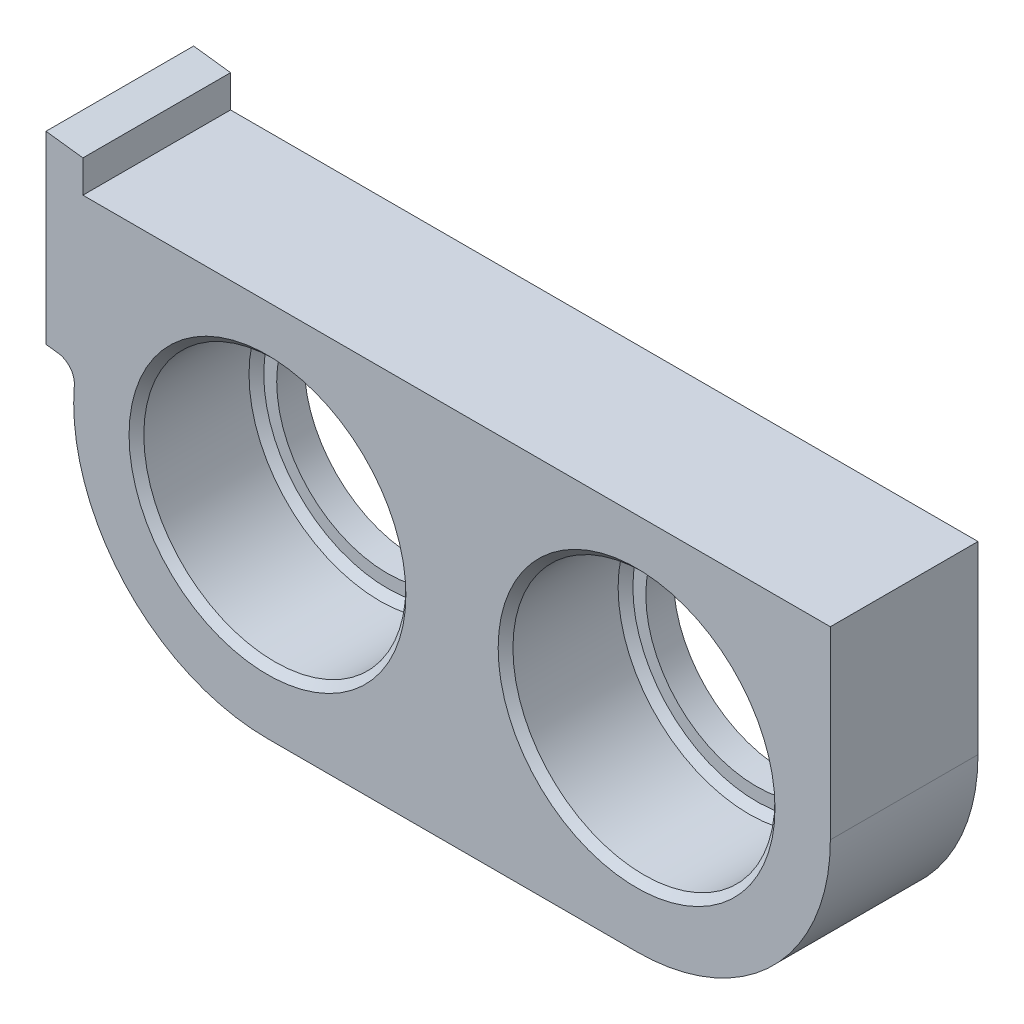
ISO-10303-21;
HEADER;
FILE_DESCRIPTION(('STEP AP214'),'2;1');
FILE_NAME('part.step','',(''),(''),'','','');
FILE_SCHEMA(('AUTOMOTIVE_DESIGN { 1 0 10303 214 1 1 1 1 }'));
ENDSEC;
DATA;
#1=APPLICATION_CONTEXT('core data for automotive mechanical design processes');
#2=APPLICATION_PROTOCOL_DEFINITION('international standard','automotive_design',2000,#1);
#3=PRODUCT_CONTEXT('',#1,'mechanical');
#4=PRODUCT('Part','Part','',(#3));
#5=PRODUCT_RELATED_PRODUCT_CATEGORY('part','',(#4));
#6=PRODUCT_DEFINITION_FORMATION('','',#4);
#7=PRODUCT_DEFINITION_CONTEXT('part definition',#1,'design');
#8=PRODUCT_DEFINITION('design','',#6,#7);
#9=PRODUCT_DEFINITION_SHAPE('','',#8);
#10=(LENGTH_UNIT() NAMED_UNIT(*) SI_UNIT(.MILLI.,.METRE.));
#11=(NAMED_UNIT(*) PLANE_ANGLE_UNIT() SI_UNIT($,.RADIAN.));
#12=(NAMED_UNIT(*) SI_UNIT($,.STERADIAN.) SOLID_ANGLE_UNIT());
#13=UNCERTAINTY_MEASURE_WITH_UNIT(LENGTH_MEASURE(1.E-05),#10,'distance_accuracy_value','');
#14=(GEOMETRIC_REPRESENTATION_CONTEXT(3) GLOBAL_UNCERTAINTY_ASSIGNED_CONTEXT((#13)) GLOBAL_UNIT_ASSIGNED_CONTEXT((#10,
#11,#12)) REPRESENTATION_CONTEXT('',''));
#15=CARTESIAN_POINT('',(0.,0.,0.));
#16=DIRECTION('',(0.,0.,1.));
#17=DIRECTION('',(1.,0.,0.));
#18=AXIS2_PLACEMENT_3D('',#15,#16,#17);
#19=CARTESIAN_POINT('',(0.,0.,8.));
#20=DIRECTION('',(0.,0.,-1.));
#21=DIRECTION('',(-1.,0.,0.));
#22=AXIS2_PLACEMENT_3D('',#19,#20,#21);
#23=CYLINDRICAL_SURFACE('',#22,7.1);
#24=CARTESIAN_POINT('',(0.,0.,1.9));
#25=DIRECTION('',(0.,0.,-1.));
#26=DIRECTION('',(-1.,0.,0.));
#27=AXIS2_PLACEMENT_3D('',#24,#25,#26);
#28=CIRCLE('',#27,7.1);
#29=CARTESIAN_POINT('',(-7.1,0.,1.9));
#30=VERTEX_POINT('',#29);
#31=EDGE_CURVE('E50',#30,#30,#28,.T.);
#32=ORIENTED_EDGE('',*,*,#31,.T.);
#33=EDGE_LOOP('',(#32));
#34=FACE_BOUND('',#33,.T.);
#35=CARTESIAN_POINT('',(0.,0.,7.6));
#36=DIRECTION('',(0.,0.,1.));
#37=DIRECTION('',(1.,0.,0.));
#38=AXIS2_PLACEMENT_3D('',#35,#36,#37);
#39=CIRCLE('',#38,7.1);
#40=CARTESIAN_POINT('',(7.1,0.,7.6));
#41=VERTEX_POINT('',#40);
#42=EDGE_CURVE('E213',#41,#41,#39,.T.);
#43=ORIENTED_EDGE('',*,*,#42,.T.);
#44=EDGE_LOOP('',(#43));
#45=FACE_BOUND('',#44,.T.);
#46=ADVANCED_FACE('F41',(#34,#45),#23,.F.);
#47=CARTESIAN_POINT('',(20.,0.,8.));
#48=DIRECTION('',(0.,0.,-1.));
#49=DIRECTION('',(-1.,0.,0.));
#50=AXIS2_PLACEMENT_3D('',#47,#48,#49);
#51=CYLINDRICAL_SURFACE('',#50,7.1);
#52=CARTESIAN_POINT('',(20.,0.,1.9));
#53=DIRECTION('',(0.,0.,-1.));
#54=DIRECTION('',(-1.,0.,0.));
#55=AXIS2_PLACEMENT_3D('',#52,#53,#54);
#56=CIRCLE('',#55,7.1);
#57=CARTESIAN_POINT('',(12.9,0.,1.9));
#58=VERTEX_POINT('',#57);
#59=EDGE_CURVE('E201',#58,#58,#56,.T.);
#60=ORIENTED_EDGE('',*,*,#59,.T.);
#61=EDGE_LOOP('',(#60));
#62=FACE_BOUND('',#61,.T.);
#63=CARTESIAN_POINT('',(20.,0.,7.6));
#64=DIRECTION('',(0.,0.,1.));
#65=DIRECTION('',(1.,0.,0.));
#66=AXIS2_PLACEMENT_3D('',#63,#64,#65);
#67=CIRCLE('',#66,7.1);
#68=CARTESIAN_POINT('',(27.1,0.,7.6));
#69=VERTEX_POINT('',#68);
#70=EDGE_CURVE('E198',#69,#69,#67,.T.);
#71=ORIENTED_EDGE('',*,*,#70,.T.);
#72=EDGE_LOOP('',(#71));
#73=FACE_BOUND('',#72,.T.);
#74=ADVANCED_FACE('F235',(#62,#73),#51,.F.);
#75=CARTESIAN_POINT('',(0.0615384615384616,0.492307692307694,8.));
#76=DIRECTION('',(0.124034734589208,0.992277876713668,0.));
#77=DIRECTION('',(-0.992277876713668,0.124034734589208,0.));
#78=AXIS2_PLACEMENT_3D('',#75,#76,#77);
#79=PLANE('',#78);
#80=DIRECTION('',(0.992277876713668,-0.124034734589208,0.));
#81=VECTOR('',#80,1.);
#82=CARTESIAN_POINT('',(0.0615384615384616,0.492307692307694,0.));
#83=LINE('',#82,#81);
#84=CARTESIAN_POINT('',(-12.,2.,0.));
#85=VERTEX_POINT('',#84);
#86=CARTESIAN_POINT('',(-11.3386990109921,1.91733737637401,0.));
#87=VERTEX_POINT('',#86);
#88=EDGE_CURVE('E157',#85,#87,#83,.T.);
#89=ORIENTED_EDGE('',*,*,#88,.T.);
#90=DIRECTION('',(0.,0.,1.));
#91=VECTOR('',#90,1.);
#92=CARTESIAN_POINT('',(-11.3386990109921,1.91733737637401,8.));
#93=LINE('',#92,#91);
#94=CARTESIAN_POINT('',(-11.3386990109921,1.91733737637401,8.));
#95=VERTEX_POINT('',#94);
#96=EDGE_CURVE('E57',#87,#95,#93,.T.);
#97=ORIENTED_EDGE('',*,*,#96,.T.);
#98=DIRECTION('',(0.992277876713668,-0.124034734589208,0.));
#99=VECTOR('',#98,1.);
#100=CARTESIAN_POINT('',(0.0615384615384616,0.492307692307694,8.));
#101=LINE('',#100,#99);
#102=CARTESIAN_POINT('',(-12.,2.,8.));
#103=VERTEX_POINT('',#102);
#104=EDGE_CURVE('E173',#103,#95,#101,.T.);
#105=ORIENTED_EDGE('',*,*,#104,.F.);
#106=DIRECTION('',(0.,0.,-1.));
#107=VECTOR('',#106,1.);
#108=CARTESIAN_POINT('',(-12.,2.,8.));
#109=LINE('',#108,#107);
#110=EDGE_CURVE('E156',#103,#85,#109,.T.);
#111=ORIENTED_EDGE('',*,*,#110,.T.);
#112=EDGE_LOOP('',(#89,#97,#105,#111));
#113=FACE_BOUND('',#112,.T.);
#114=ADVANCED_FACE('F240',(#113),#79,.F.);
#115=CARTESIAN_POINT('',(0.,0.,8.));
#116=DIRECTION('',(0.,0.,-1.));
#117=DIRECTION('',(-1.,0.,0.));
#118=AXIS2_PLACEMENT_3D('',#115,#116,#117);
#119=CYLINDRICAL_SURFACE('',#118,10.5);
#120=CARTESIAN_POINT('',(0.,0.,8.));
#121=DIRECTION('',(0.,0.,1.));
#122=DIRECTION('',(1.,0.,0.));
#123=AXIS2_PLACEMENT_3D('',#120,#121,#122);
#124=CIRCLE('',#123,10.5);
#125=CARTESIAN_POINT('',(-10.4659742894438,0.844619543168139,8.));
#126=VERTEX_POINT('',#125);
#127=CARTESIAN_POINT('',(0.,-10.5,8.));
#128=VERTEX_POINT('',#127);
#129=EDGE_CURVE('E314',#126,#128,#124,.T.);
#130=ORIENTED_EDGE('',*,*,#129,.F.);
#131=DIRECTION('',(0.,0.,-1.));
#132=VECTOR('',#131,1.);
#133=CARTESIAN_POINT('',(-10.4659742894438,0.844619543168139,8.));
#134=LINE('',#133,#132);
#135=CARTESIAN_POINT('',(-10.4659742894438,0.844619543168139,0.));
#136=VERTEX_POINT('',#135);
#137=EDGE_CURVE('E191',#126,#136,#134,.T.);
#138=ORIENTED_EDGE('',*,*,#137,.T.);
#139=CARTESIAN_POINT('',(0.,0.,0.));
#140=DIRECTION('',(0.,0.,1.));
#141=DIRECTION('',(1.,0.,0.));
#142=AXIS2_PLACEMENT_3D('',#139,#140,#141);
#143=CIRCLE('',#142,10.5);
#144=CARTESIAN_POINT('',(0.,-10.5,0.));
#145=VERTEX_POINT('',#144);
#146=EDGE_CURVE('E159',#136,#145,#143,.T.);
#147=ORIENTED_EDGE('',*,*,#146,.T.);
#148=DIRECTION('',(0.,0.,-1.));
#149=VECTOR('',#148,1.);
#150=CARTESIAN_POINT('',(0.,-10.5,8.));
#151=LINE('',#150,#149);
#152=EDGE_CURVE('E183',#128,#145,#151,.T.);
#153=ORIENTED_EDGE('',*,*,#152,.F.);
#154=EDGE_LOOP('',(#130,#138,#147,#153));
#155=FACE_BOUND('',#154,.T.);
#156=ADVANCED_FACE('F264',(#155),#119,.T.);
#157=CARTESIAN_POINT('',(0.,-10.5,8.));
#158=DIRECTION('',(0.,1.,0.));
#159=DIRECTION('',(0.,0.,1.));
#160=AXIS2_PLACEMENT_3D('',#157,#158,#159);
#161=PLANE('',#160);
#162=DIRECTION('',(1.,0.,0.));
#163=VECTOR('',#162,1.);
#164=CARTESIAN_POINT('',(0.,-10.5,0.));
#165=LINE('',#164,#163);
#166=CARTESIAN_POINT('',(20.,-10.5,0.));
#167=VERTEX_POINT('',#166);
#168=EDGE_CURVE('E162',#145,#167,#165,.T.);
#169=ORIENTED_EDGE('',*,*,#168,.T.);
#170=DIRECTION('',(0.,0.,-1.));
#171=VECTOR('',#170,1.);
#172=CARTESIAN_POINT('',(20.,-10.5,8.));
#173=LINE('',#172,#171);
#174=CARTESIAN_POINT('',(20.,-10.5,8.));
#175=VERTEX_POINT('',#174);
#176=EDGE_CURVE('E180',#175,#167,#173,.T.);
#177=ORIENTED_EDGE('',*,*,#176,.F.);
#178=DIRECTION('',(1.,0.,0.));
#179=VECTOR('',#178,1.);
#180=CARTESIAN_POINT('',(0.,-10.5,8.));
#181=LINE('',#180,#179);
#182=EDGE_CURVE('E151',#128,#175,#181,.T.);
#183=ORIENTED_EDGE('',*,*,#182,.F.);
#184=ORIENTED_EDGE('',*,*,#152,.T.);
#185=EDGE_LOOP('',(#169,#177,#183,#184));
#186=FACE_BOUND('',#185,.T.);
#187=ADVANCED_FACE('F260',(#186),#161,.F.);
#188=CARTESIAN_POINT('',(20.,0.,8.));
#189=DIRECTION('',(0.,0.,-1.));
#190=DIRECTION('',(-1.,0.,0.));
#191=AXIS2_PLACEMENT_3D('',#188,#189,#190);
#192=CYLINDRICAL_SURFACE('',#191,10.5);
#193=CARTESIAN_POINT('',(20.,0.,0.));
#194=DIRECTION('',(0.,0.,1.));
#195=DIRECTION('',(1.,0.,0.));
#196=AXIS2_PLACEMENT_3D('',#193,#194,#195);
#197=CIRCLE('',#196,10.5);
#198=CARTESIAN_POINT('',(30.5,0.,0.));
#199=VERTEX_POINT('',#198);
#200=EDGE_CURVE('E164',#167,#199,#197,.T.);
#201=ORIENTED_EDGE('',*,*,#200,.T.);
#202=DIRECTION('',(0.,0.,-1.));
#203=VECTOR('',#202,1.);
#204=CARTESIAN_POINT('',(30.5,0.,8.));
#205=LINE('',#204,#203);
#206=CARTESIAN_POINT('',(30.5,0.,8.));
#207=VERTEX_POINT('',#206);
#208=EDGE_CURVE('E178',#207,#199,#205,.T.);
#209=ORIENTED_EDGE('',*,*,#208,.F.);
#210=CARTESIAN_POINT('',(20.,0.,8.));
#211=DIRECTION('',(0.,0.,1.));
#212=DIRECTION('',(1.,0.,0.));
#213=AXIS2_PLACEMENT_3D('',#210,#211,#212);
#214=CIRCLE('',#213,10.5);
#215=EDGE_CURVE('E144',#175,#207,#214,.T.);
#216=ORIENTED_EDGE('',*,*,#215,.F.);
#217=ORIENTED_EDGE('',*,*,#176,.T.);
#218=EDGE_LOOP('',(#201,#209,#216,#217));
#219=FACE_BOUND('',#218,.T.);
#220=ADVANCED_FACE('F257',(#219),#192,.T.);
#221=CARTESIAN_POINT('',(30.5,0.,8.));
#222=DIRECTION('',(1.,0.,0.));
#223=DIRECTION('',(0.,0.,-1.));
#224=AXIS2_PLACEMENT_3D('',#221,#222,#223);
#225=PLANE('',#224);
#226=DIRECTION('',(0.,0.,-1.));
#227=VECTOR('',#226,1.);
#228=CARTESIAN_POINT('',(30.5,10.,9.));
#229=LINE('',#228,#227);
#230=CARTESIAN_POINT('',(30.5,10.,8.));
#231=VERTEX_POINT('',#230);
#232=CARTESIAN_POINT('',(30.5,10.,0.));
#233=VERTEX_POINT('',#232);
#234=EDGE_CURVE('E125',#231,#233,#229,.T.);
#235=ORIENTED_EDGE('',*,*,#234,.F.);
#236=DIRECTION('',(0.,-1.,0.));
#237=VECTOR('',#236,1.);
#238=CARTESIAN_POINT('',(30.5,0.,8.));
#239=LINE('',#238,#237);
#240=EDGE_CURVE('E138',#231,#207,#239,.T.);
#241=ORIENTED_EDGE('',*,*,#240,.T.);
#242=ORIENTED_EDGE('',*,*,#208,.T.);
#243=DIRECTION('',(0.,-1.,0.));
#244=VECTOR('',#243,1.);
#245=CARTESIAN_POINT('',(30.5,0.,0.));
#246=LINE('',#245,#244);
#247=EDGE_CURVE('E140',#233,#199,#246,.T.);
#248=ORIENTED_EDGE('',*,*,#247,.F.);
#249=EDGE_LOOP('',(#235,#241,#242,#248));
#250=FACE_BOUND('',#249,.T.);
#251=ADVANCED_FACE('F136',(#250),#225,.T.);
#252=CARTESIAN_POINT('',(1.29230769230769,10.3384615384615,8.));
#253=DIRECTION('',(0.124034734589208,0.992277876713668,0.));
#254=DIRECTION('',(-0.992277876713668,0.124034734589208,0.));
#255=AXIS2_PLACEMENT_3D('',#252,#253,#254);
#256=PLANE('',#255);
#257=DIRECTION('',(0.,0.,1.));
#258=VECTOR('',#257,1.);
#259=CARTESIAN_POINT('',(-10.,11.75,8.));
#260=LINE('',#259,#258);
#261=CARTESIAN_POINT('',(-10.,11.75,0.));
#262=VERTEX_POINT('',#261);
#263=CARTESIAN_POINT('',(-10.,11.75,8.));
#264=VERTEX_POINT('',#263);
#265=EDGE_CURVE('E326',#262,#264,#260,.T.);
#266=ORIENTED_EDGE('',*,*,#265,.F.);
#267=DIRECTION('',(0.992277876713668,-0.124034734589208,0.));
#268=VECTOR('',#267,1.);
#269=CARTESIAN_POINT('',(1.29230769230769,10.3384615384615,0.));
#270=LINE('',#269,#268);
#271=CARTESIAN_POINT('',(-12.,12.,0.));
#272=VERTEX_POINT('',#271);
#273=EDGE_CURVE('E168',#272,#262,#270,.T.);
#274=ORIENTED_EDGE('',*,*,#273,.F.);
#275=DIRECTION('',(0.,0.,-1.));
#276=VECTOR('',#275,1.);
#277=CARTESIAN_POINT('',(-12.,12.,8.));
#278=LINE('',#277,#276);
#279=CARTESIAN_POINT('',(-12.,12.,8.));
#280=VERTEX_POINT('',#279);
#281=EDGE_CURVE('E176',#280,#272,#278,.T.);
#282=ORIENTED_EDGE('',*,*,#281,.F.);
#283=DIRECTION('',(0.992277876713668,-0.124034734589208,0.));
#284=VECTOR('',#283,1.);
#285=CARTESIAN_POINT('',(1.29230769230769,10.3384615384615,8.));
#286=LINE('',#285,#284);
#287=EDGE_CURVE('E146',#280,#264,#286,.T.);
#288=ORIENTED_EDGE('',*,*,#287,.T.);
#289=EDGE_LOOP('',(#266,#274,#282,#288));
#290=FACE_BOUND('',#289,.T.);
#291=ADVANCED_FACE('F250',(#290),#256,.T.);
#292=CARTESIAN_POINT('',(-12.,0.,8.));
#293=DIRECTION('',(1.,0.,0.));
#294=DIRECTION('',(0.,0.,-1.));
#295=AXIS2_PLACEMENT_3D('',#292,#293,#294);
#296=PLANE('',#295);
#297=DIRECTION('',(0.,-1.,0.));
#298=VECTOR('',#297,1.);
#299=CARTESIAN_POINT('',(-12.,0.,0.));
#300=LINE('',#299,#298);
#301=EDGE_CURVE('E171',#272,#85,#300,.T.);
#302=ORIENTED_EDGE('',*,*,#301,.T.);
#303=ORIENTED_EDGE('',*,*,#110,.F.);
#304=DIRECTION('',(0.,-1.,0.));
#305=VECTOR('',#304,1.);
#306=CARTESIAN_POINT('',(-12.,0.,8.));
#307=LINE('',#306,#305);
#308=EDGE_CURVE('E149',#280,#103,#307,.T.);
#309=ORIENTED_EDGE('',*,*,#308,.F.);
#310=ORIENTED_EDGE('',*,*,#281,.T.);
#311=EDGE_LOOP('',(#302,#303,#309,#310));
#312=FACE_BOUND('',#311,.T.);
#313=ADVANCED_FACE('F247',(#312),#296,.F.);
#314=CARTESIAN_POINT('',(0.,0.,8.));
#315=DIRECTION('',(0.,0.,1.));
#316=DIRECTION('',(1.,0.,0.));
#317=AXIS2_PLACEMENT_3D('',#314,#315,#316);
#318=PLANE('',#317);
#319=CARTESIAN_POINT('',(20.,0.,8.));
#320=DIRECTION('',(0.,0.,1.));
#321=DIRECTION('',(1.,0.,0.));
#322=AXIS2_PLACEMENT_3D('',#319,#320,#321);
#323=CIRCLE('',#322,7.5);
#324=CARTESIAN_POINT('',(27.5,0.,8.));
#325=VERTEX_POINT('',#324);
#326=EDGE_CURVE('E210',#325,#325,#323,.F.);
#327=ORIENTED_EDGE('',*,*,#326,.T.);
#328=EDGE_LOOP('',(#327));
#329=FACE_BOUND('',#328,.T.);
#330=CARTESIAN_POINT('',(0.,0.,8.));
#331=DIRECTION('',(0.,0.,1.));
#332=DIRECTION('',(1.,0.,0.));
#333=AXIS2_PLACEMENT_3D('',#330,#331,#332);
#334=CIRCLE('',#333,7.5);
#335=CARTESIAN_POINT('',(7.5,0.,8.));
#336=VERTEX_POINT('',#335);
#337=EDGE_CURVE('E207',#336,#336,#334,.F.);
#338=ORIENTED_EDGE('',*,*,#337,.T.);
#339=EDGE_LOOP('',(#338));
#340=FACE_BOUND('',#339,.T.);
#341=DIRECTION('',(1.,0.,0.));
#342=VECTOR('',#341,1.);
#343=CARTESIAN_POINT('',(0.,10.,8.));
#344=LINE('',#343,#342);
#345=CARTESIAN_POINT('',(-10.,10.,8.));
#346=VERTEX_POINT('',#345);
#347=EDGE_CURVE('E121',#346,#231,#344,.T.);
#348=ORIENTED_EDGE('',*,*,#347,.F.);
#349=DIRECTION('',(0.,-1.,0.));
#350=VECTOR('',#349,1.);
#351=CARTESIAN_POINT('',(-10.,0.,8.));
#352=LINE('',#351,#350);
#353=EDGE_CURVE('E132',#264,#346,#352,.T.);
#354=ORIENTED_EDGE('',*,*,#353,.F.);
#355=ORIENTED_EDGE('',*,*,#287,.F.);
#356=ORIENTED_EDGE('',*,*,#308,.T.);
#357=ORIENTED_EDGE('',*,*,#104,.T.);
#358=CARTESIAN_POINT('',(-11.4627337455813,0.925059499660343,8.));
#359=DIRECTION('',(0.,0.,1.));
#360=DIRECTION('',(1.,0.,0.));
#361=AXIS2_PLACEMENT_3D('',#358,#359,#360);
#362=CIRCLE('',#361,1.);
#363=EDGE_CURVE('E196',#95,#126,#362,.F.);
#364=ORIENTED_EDGE('',*,*,#363,.T.);
#365=ORIENTED_EDGE('',*,*,#129,.T.);
#366=ORIENTED_EDGE('',*,*,#182,.T.);
#367=ORIENTED_EDGE('',*,*,#215,.T.);
#368=ORIENTED_EDGE('',*,*,#240,.F.);
#369=EDGE_LOOP('',(#348,#354,#355,#356,#357,#364,#365,#366,#367,#368));
#370=FACE_BOUND('',#369,.T.);
#371=ADVANCED_FACE('F142',(#329,#340,#370),#318,.T.);
#372=CARTESIAN_POINT('',(0.,0.,0.));
#373=DIRECTION('',(0.,0.,1.));
#374=DIRECTION('',(1.,0.,0.));
#375=AXIS2_PLACEMENT_3D('',#372,#373,#374);
#376=PLANE('',#375);
#377=DIRECTION('',(0.,-1.,0.));
#378=VECTOR('',#377,1.);
#379=CARTESIAN_POINT('',(-10.,0.,0.));
#380=LINE('',#379,#378);
#381=CARTESIAN_POINT('',(-10.,10.,0.));
#382=VERTEX_POINT('',#381);
#383=EDGE_CURVE('E186',#262,#382,#380,.T.);
#384=ORIENTED_EDGE('',*,*,#383,.T.);
#385=DIRECTION('',(1.,0.,0.));
#386=VECTOR('',#385,1.);
#387=CARTESIAN_POINT('',(0.,10.,0.));
#388=LINE('',#387,#386);
#389=EDGE_CURVE('E189',#382,#233,#388,.T.);
#390=ORIENTED_EDGE('',*,*,#389,.T.);
#391=ORIENTED_EDGE('',*,*,#247,.T.);
#392=ORIENTED_EDGE('',*,*,#200,.F.);
#393=ORIENTED_EDGE('',*,*,#168,.F.);
#394=ORIENTED_EDGE('',*,*,#146,.F.);
#395=CARTESIAN_POINT('',(-11.4627337455813,0.925059499660343,0.));
#396=DIRECTION('',(0.,0.,1.));
#397=DIRECTION('',(1.,0.,0.));
#398=AXIS2_PLACEMENT_3D('',#395,#396,#397);
#399=CIRCLE('',#398,1.);
#400=EDGE_CURVE('E65',#136,#87,#399,.T.);
#401=ORIENTED_EDGE('',*,*,#400,.T.);
#402=ORIENTED_EDGE('',*,*,#88,.F.);
#403=ORIENTED_EDGE('',*,*,#301,.F.);
#404=ORIENTED_EDGE('',*,*,#273,.T.);
#405=EDGE_LOOP('',(#384,#390,#391,#392,#393,#394,#401,#402,#403,#404));
#406=FACE_BOUND('',#405,.T.);
#407=CARTESIAN_POINT('',(20.,0.,0.));
#408=DIRECTION('',(0.,0.,-1.));
#409=DIRECTION('',(-1.,0.,0.));
#410=AXIS2_PLACEMENT_3D('',#407,#408,#409);
#411=CIRCLE('',#410,6.);
#412=CARTESIAN_POINT('',(14.,0.,0.));
#413=VERTEX_POINT('',#412);
#414=EDGE_CURVE('E305',#413,#413,#411,.T.);
#415=ORIENTED_EDGE('',*,*,#414,.F.);
#416=EDGE_LOOP('',(#415));
#417=FACE_BOUND('',#416,.T.);
#418=CARTESIAN_POINT('',(0.,0.,0.));
#419=DIRECTION('',(0.,0.,-1.));
#420=DIRECTION('',(-1.,0.,0.));
#421=AXIS2_PLACEMENT_3D('',#418,#419,#420);
#422=CIRCLE('',#421,6.);
#423=CARTESIAN_POINT('',(-6.,0.,0.));
#424=VERTEX_POINT('',#423);
#425=EDGE_CURVE('E131',#424,#424,#422,.T.);
#426=ORIENTED_EDGE('',*,*,#425,.F.);
#427=EDGE_LOOP('',(#426));
#428=FACE_BOUND('',#427,.T.);
#429=ADVANCED_FACE('F244',(#406,#417,#428),#376,.F.);
#430=CARTESIAN_POINT('',(20.,0.,1.5));
#431=DIRECTION('',(0.,0.,-1.));
#432=DIRECTION('',(-1.,0.,0.));
#433=AXIS2_PLACEMENT_3D('',#430,#431,#432);
#434=PLANE('',#433);
#435=CARTESIAN_POINT('',(20.,0.,1.5));
#436=DIRECTION('',(0.,0.,-1.));
#437=DIRECTION('',(-1.,0.,0.));
#438=AXIS2_PLACEMENT_3D('',#435,#436,#437);
#439=CIRCLE('',#438,6.7);
#440=CARTESIAN_POINT('',(13.3,0.,1.5));
#441=VERTEX_POINT('',#440);
#442=EDGE_CURVE('E204',#441,#441,#439,.F.);
#443=ORIENTED_EDGE('',*,*,#442,.T.);
#444=EDGE_LOOP('',(#443));
#445=FACE_BOUND('',#444,.T.);
#446=CARTESIAN_POINT('',(20.,0.,1.5));
#447=DIRECTION('',(0.,0.,-1.));
#448=DIRECTION('',(-1.,0.,0.));
#449=AXIS2_PLACEMENT_3D('',#446,#447,#448);
#450=CIRCLE('',#449,6.);
#451=CARTESIAN_POINT('',(14.,0.,1.5));
#452=VERTEX_POINT('',#451);
#453=EDGE_CURVE('E160',#452,#452,#450,.T.);
#454=ORIENTED_EDGE('',*,*,#453,.T.);
#455=EDGE_LOOP('',(#454));
#456=FACE_BOUND('',#455,.T.);
#457=ADVANCED_FACE('F297',(#445,#456),#434,.F.);
#458=CARTESIAN_POINT('',(20.,0.,1.5));
#459=DIRECTION('',(0.,0.,-1.));
#460=DIRECTION('',(-1.,0.,0.));
#461=AXIS2_PLACEMENT_3D('',#458,#459,#460);
#462=CYLINDRICAL_SURFACE('',#461,6.);
#463=ORIENTED_EDGE('',*,*,#453,.F.);
#464=EDGE_LOOP('',(#463));
#465=FACE_BOUND('',#464,.T.);
#466=ORIENTED_EDGE('',*,*,#414,.T.);
#467=EDGE_LOOP('',(#466));
#468=FACE_BOUND('',#467,.T.);
#469=ADVANCED_FACE('F300',(#465,#468),#462,.F.);
#470=CARTESIAN_POINT('',(0.,0.,1.5));
#471=DIRECTION('',(0.,0.,-1.));
#472=DIRECTION('',(-1.,0.,0.));
#473=AXIS2_PLACEMENT_3D('',#470,#471,#472);
#474=PLANE('',#473);
#475=CARTESIAN_POINT('',(0.,0.,1.5));
#476=DIRECTION('',(0.,0.,-1.));
#477=DIRECTION('',(-1.,0.,0.));
#478=AXIS2_PLACEMENT_3D('',#475,#476,#477);
#479=CIRCLE('',#478,6.7);
#480=CARTESIAN_POINT('',(-6.7,0.,1.5));
#481=VERTEX_POINT('',#480);
#482=EDGE_CURVE('E11',#481,#481,#479,.F.);
#483=ORIENTED_EDGE('',*,*,#482,.T.);
#484=EDGE_LOOP('',(#483));
#485=FACE_BOUND('',#484,.T.);
#486=CARTESIAN_POINT('',(0.,0.,1.5));
#487=DIRECTION('',(0.,0.,-1.));
#488=DIRECTION('',(-1.,0.,0.));
#489=AXIS2_PLACEMENT_3D('',#486,#487,#488);
#490=CIRCLE('',#489,6.);
#491=CARTESIAN_POINT('',(-6.,0.,1.5));
#492=VERTEX_POINT('',#491);
#493=EDGE_CURVE('E308',#492,#492,#490,.T.);
#494=ORIENTED_EDGE('',*,*,#493,.T.);
#495=EDGE_LOOP('',(#494));
#496=FACE_BOUND('',#495,.T.);
#497=ADVANCED_FACE('F350',(#485,#496),#474,.F.);
#498=CARTESIAN_POINT('',(0.,0.,1.5));
#499=DIRECTION('',(0.,0.,-1.));
#500=DIRECTION('',(-1.,0.,0.));
#501=AXIS2_PLACEMENT_3D('',#498,#499,#500);
#502=CYLINDRICAL_SURFACE('',#501,6.);
#503=ORIENTED_EDGE('',*,*,#493,.F.);
#504=EDGE_LOOP('',(#503));
#505=FACE_BOUND('',#504,.T.);
#506=ORIENTED_EDGE('',*,*,#425,.T.);
#507=EDGE_LOOP('',(#506));
#508=FACE_BOUND('',#507,.T.);
#509=ADVANCED_FACE('F337',(#505,#508),#502,.F.);
#510=CARTESIAN_POINT('',(-10.,10.,9.));
#511=DIRECTION('',(0.,-1.,0.));
#512=DIRECTION('',(0.,0.,-1.));
#513=AXIS2_PLACEMENT_3D('',#510,#511,#512);
#514=PLANE('',#513);
#515=ORIENTED_EDGE('',*,*,#347,.T.);
#516=ORIENTED_EDGE('',*,*,#234,.T.);
#517=ORIENTED_EDGE('',*,*,#389,.F.);
#518=DIRECTION('',(0.,0.,-1.));
#519=VECTOR('',#518,1.);
#520=CARTESIAN_POINT('',(-10.,10.,9.));
#521=LINE('',#520,#519);
#522=EDGE_CURVE('E127',#346,#382,#521,.T.);
#523=ORIENTED_EDGE('',*,*,#522,.F.);
#524=EDGE_LOOP('',(#515,#516,#517,#523));
#525=FACE_BOUND('',#524,.T.);
#526=ADVANCED_FACE('F123',(#525),#514,.F.);
#527=CARTESIAN_POINT('',(-10.,0.,0.));
#528=DIRECTION('',(-1.,0.,0.));
#529=DIRECTION('',(0.,0.,1.));
#530=AXIS2_PLACEMENT_3D('',#527,#528,#529);
#531=PLANE('',#530);
#532=ORIENTED_EDGE('',*,*,#353,.T.);
#533=ORIENTED_EDGE('',*,*,#522,.T.);
#534=ORIENTED_EDGE('',*,*,#383,.F.);
#535=ORIENTED_EDGE('',*,*,#265,.T.);
#536=EDGE_LOOP('',(#532,#533,#534,#535));
#537=FACE_BOUND('',#536,.T.);
#538=ADVANCED_FACE('F274',(#537),#531,.F.);
#539=CARTESIAN_POINT('',(-11.4627337455813,0.925059499660343,8.));
#540=DIRECTION('',(0.,0.,-1.));
#541=DIRECTION('',(-1.,0.,0.));
#542=AXIS2_PLACEMENT_3D('',#539,#540,#541);
#543=CYLINDRICAL_SURFACE('',#542,1.);
#544=ORIENTED_EDGE('',*,*,#363,.F.);
#545=ORIENTED_EDGE('',*,*,#96,.F.);
#546=ORIENTED_EDGE('',*,*,#400,.F.);
#547=ORIENTED_EDGE('',*,*,#137,.F.);
#548=EDGE_LOOP('',(#544,#545,#546,#547));
#549=FACE_BOUND('',#548,.T.);
#550=ADVANCED_FACE('F271',(#549),#543,.F.);
#551=CARTESIAN_POINT('',(20.,0.,1.9));
#552=DIRECTION('',(0.,0.,1.));
#553=DIRECTION('',(1.,0.,0.));
#554=AXIS2_PLACEMENT_3D('',#551,#552,#553);
#555=CONICAL_SURFACE('',#554,7.1,0.785398163397445);
#556=ORIENTED_EDGE('',*,*,#442,.F.);
#557=EDGE_LOOP('',(#556));
#558=FACE_BOUND('',#557,.T.);
#559=ORIENTED_EDGE('',*,*,#59,.F.);
#560=EDGE_LOOP('',(#559));
#561=FACE_BOUND('',#560,.T.);
#562=ADVANCED_FACE('F229',(#558,#561),#555,.F.);
#563=CARTESIAN_POINT('',(20.,0.,7.6));
#564=DIRECTION('',(0.,0.,1.));
#565=DIRECTION('',(1.,0.,0.));
#566=AXIS2_PLACEMENT_3D('',#563,#564,#565);
#567=CONICAL_SURFACE('',#566,7.1,0.785398163397453);
#568=ORIENTED_EDGE('',*,*,#326,.F.);
#569=EDGE_LOOP('',(#568));
#570=FACE_BOUND('',#569,.T.);
#571=ORIENTED_EDGE('',*,*,#70,.F.);
#572=EDGE_LOOP('',(#571));
#573=FACE_BOUND('',#572,.T.);
#574=ADVANCED_FACE('F222',(#570,#573),#567,.F.);
#575=CARTESIAN_POINT('',(0.,0.,1.9));
#576=DIRECTION('',(0.,0.,1.));
#577=DIRECTION('',(1.,0.,0.));
#578=AXIS2_PLACEMENT_3D('',#575,#576,#577);
#579=CONICAL_SURFACE('',#578,7.1,0.785398163397444);
#580=ORIENTED_EDGE('',*,*,#482,.F.);
#581=EDGE_LOOP('',(#580));
#582=FACE_BOUND('',#581,.T.);
#583=ORIENTED_EDGE('',*,*,#31,.F.);
#584=EDGE_LOOP('',(#583));
#585=FACE_BOUND('',#584,.T.);
#586=ADVANCED_FACE('F220',(#582,#585),#579,.F.);
#587=CARTESIAN_POINT('',(0.,0.,7.6));
#588=DIRECTION('',(0.,0.,1.));
#589=DIRECTION('',(1.,0.,0.));
#590=AXIS2_PLACEMENT_3D('',#587,#588,#589);
#591=CONICAL_SURFACE('',#590,7.1,0.785398163397453);
#592=ORIENTED_EDGE('',*,*,#337,.F.);
#593=EDGE_LOOP('',(#592));
#594=FACE_BOUND('',#593,.T.);
#595=ORIENTED_EDGE('',*,*,#42,.F.);
#596=EDGE_LOOP('',(#595));
#597=FACE_BOUND('',#596,.T.);
#598=ADVANCED_FACE('F44',(#594,#597),#591,.F.);
#599=CLOSED_SHELL('',(#46,#74,#114,#156,#187,#220,#251,#291,#313,#371,#429,#457,#469,#497,#509,
#526,#538,#550,#562,#574,#586,#598));
#600=MANIFOLD_SOLID_BREP('B2',#599);
#601=ADVANCED_BREP_SHAPE_REPRESENTATION('',(#18,#600),#14);
#602=SHAPE_DEFINITION_REPRESENTATION(#9,#601);
ENDSEC;
END-ISO-10303-21;
